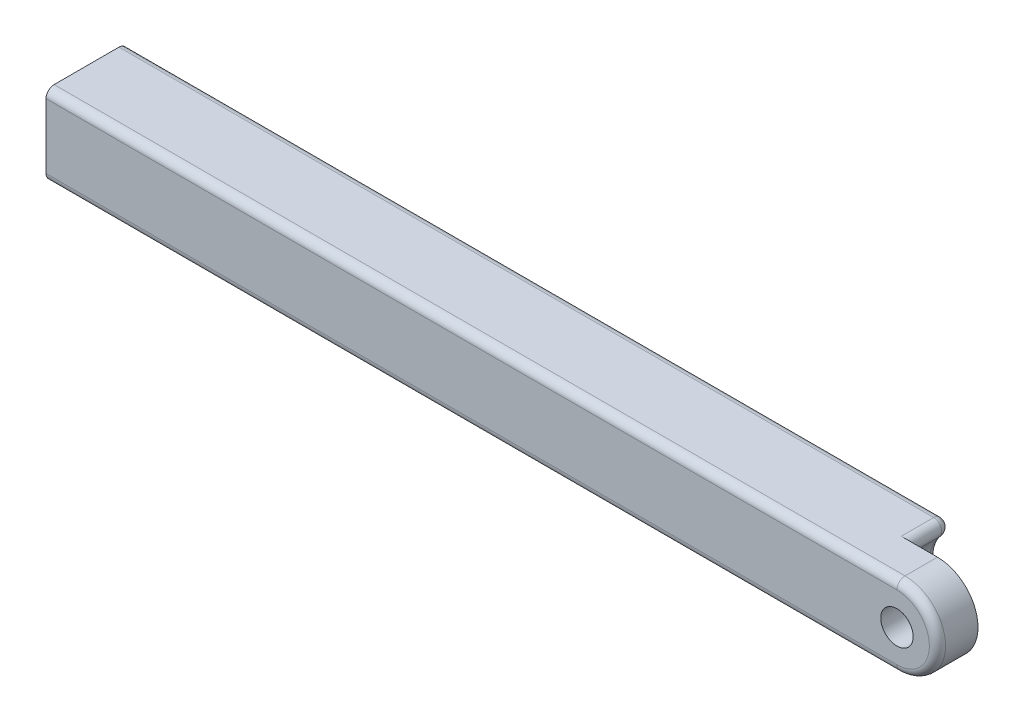
ISO-10303-21;
HEADER;
FILE_DESCRIPTION(('STEP AP214'),'2;1');
FILE_NAME('part.step','',(''),(''),'','','');
FILE_SCHEMA(('AUTOMOTIVE_DESIGN { 1 0 10303 214 1 1 1 1 }'));
ENDSEC;
DATA;
#1=APPLICATION_CONTEXT('core data for automotive mechanical design processes');
#2=APPLICATION_PROTOCOL_DEFINITION('international standard','automotive_design',2000,#1);
#3=PRODUCT_CONTEXT('',#1,'mechanical');
#4=PRODUCT('Part','Part','',(#3));
#5=PRODUCT_RELATED_PRODUCT_CATEGORY('part','',(#4));
#6=PRODUCT_DEFINITION_FORMATION('','',#4);
#7=PRODUCT_DEFINITION_CONTEXT('part definition',#1,'design');
#8=PRODUCT_DEFINITION('design','',#6,#7);
#9=PRODUCT_DEFINITION_SHAPE('','',#8);
#10=(LENGTH_UNIT() NAMED_UNIT(*) SI_UNIT(.MILLI.,.METRE.));
#11=(NAMED_UNIT(*) PLANE_ANGLE_UNIT() SI_UNIT($,.RADIAN.));
#12=(NAMED_UNIT(*) SI_UNIT($,.STERADIAN.) SOLID_ANGLE_UNIT());
#13=UNCERTAINTY_MEASURE_WITH_UNIT(LENGTH_MEASURE(1.E-05),#10,'distance_accuracy_value','');
#14=(GEOMETRIC_REPRESENTATION_CONTEXT(3) GLOBAL_UNCERTAINTY_ASSIGNED_CONTEXT((#13)) GLOBAL_UNIT_ASSIGNED_CONTEXT((#10,
#11,#12)) REPRESENTATION_CONTEXT('',''));
#15=CARTESIAN_POINT('',(0.,0.,0.));
#16=DIRECTION('',(0.,0.,1.));
#17=DIRECTION('',(1.,0.,0.));
#18=AXIS2_PLACEMENT_3D('',#15,#16,#17);
#19=CARTESIAN_POINT('',(0.,100.,-100.));
#20=DIRECTION('',(0.,0.,1.));
#21=DIRECTION('',(1.,0.,0.));
#22=AXIS2_PLACEMENT_3D('',#19,#20,#21);
#23=PLANE('',#22);
#24=DIRECTION('',(-1.,0.,0.));
#25=VECTOR('',#24,1.);
#26=CARTESIAN_POINT('',(0.,90.,-100.));
#27=LINE('',#26,#25);
#28=CARTESIAN_POINT('',(-1050.,90.,-99.9999999999999));
#29=VERTEX_POINT('',#28);
#30=CARTESIAN_POINT('',(-44.7213595499958,90.,-100.));
#31=VERTEX_POINT('',#30);
#32=EDGE_CURVE('E175',#29,#31,#27,.F.);
#33=ORIENTED_EDGE('',*,*,#32,.T.);
#34=CARTESIAN_POINT('',(0.,50.,-100.));
#35=DIRECTION('',(0.,0.,1.));
#36=DIRECTION('',(1.,0.,0.));
#37=AXIS2_PLACEMENT_3D('',#34,#35,#36);
#38=CIRCLE('',#37,60.);
#39=CARTESIAN_POINT('',(-44.7213595499958,9.99999999999999,-100.));
#40=VERTEX_POINT('',#39);
#41=EDGE_CURVE('E192',#31,#40,#38,.T.);
#42=ORIENTED_EDGE('',*,*,#41,.T.);
#43=DIRECTION('',(-1.,0.,0.));
#44=VECTOR('',#43,1.);
#45=CARTESIAN_POINT('',(0.,9.99999999999999,-100.));
#46=LINE('',#45,#44);
#47=CARTESIAN_POINT('',(-1050.,9.99999999999999,-99.9999999999999));
#48=VERTEX_POINT('',#47);
#49=EDGE_CURVE('E177',#40,#48,#46,.T.);
#50=ORIENTED_EDGE('',*,*,#49,.T.);
#51=DIRECTION('',(0.,-1.,0.));
#52=VECTOR('',#51,1.);
#53=CARTESIAN_POINT('',(-1050.,100.,-99.9999999999999));
#54=LINE('',#53,#52);
#55=EDGE_CURVE('E145',#29,#48,#54,.T.);
#56=ORIENTED_EDGE('',*,*,#55,.F.);
#57=EDGE_LOOP('',(#33,#42,#50,#56));
#58=FACE_BOUND('',#57,.T.);
#59=ADVANCED_FACE('F32',(#58),#23,.F.);
#60=CARTESIAN_POINT('',(-1050.,100.,1.2858366715135E-13));
#61=DIRECTION('',(1.,0.,0.));
#62=DIRECTION('',(0.,0.,-1.));
#63=AXIS2_PLACEMENT_3D('',#60,#61,#62);
#64=PLANE('',#63);
#65=DIRECTION('',(0.,-1.,0.));
#66=VECTOR('',#65,1.);
#67=CARTESIAN_POINT('',(-1050.,100.,1.2858366715135E-13));
#68=LINE('',#67,#66);
#69=CARTESIAN_POINT('',(-1050.,90.,1.2858366715135E-13));
#70=VERTEX_POINT('',#69);
#71=CARTESIAN_POINT('',(-1050.,9.99999999999999,1.2858366715135E-13));
#72=VERTEX_POINT('',#71);
#73=EDGE_CURVE('E150',#70,#72,#68,.T.);
#74=ORIENTED_EDGE('',*,*,#73,.F.);
#75=CARTESIAN_POINT('',(-1050.,90.,-9.99999999999987));
#76=DIRECTION('',(1.,0.,0.));
#77=DIRECTION('',(0.,0.,-1.));
#78=AXIS2_PLACEMENT_3D('',#75,#76,#77);
#79=CIRCLE('',#78,10.);
#80=CARTESIAN_POINT('',(-1050.,100.,-9.99999999999987));
#81=VERTEX_POINT('',#80);
#82=EDGE_CURVE('E168',#70,#81,#79,.F.);
#83=ORIENTED_EDGE('',*,*,#82,.T.);
#84=DIRECTION('',(0.,0.,1.));
#85=VECTOR('',#84,1.);
#86=CARTESIAN_POINT('',(-1050.,100.,1.2858366715135E-13));
#87=LINE('',#86,#85);
#88=CARTESIAN_POINT('',(-1050.,100.,-89.9999999999999));
#89=VERTEX_POINT('',#88);
#90=EDGE_CURVE('E246',#89,#81,#87,.T.);
#91=ORIENTED_EDGE('',*,*,#90,.F.);
#92=CARTESIAN_POINT('',(-1050.,90.,-89.9999999999999));
#93=DIRECTION('',(1.,0.,0.));
#94=DIRECTION('',(0.,0.,-1.));
#95=AXIS2_PLACEMENT_3D('',#92,#93,#94);
#96=CIRCLE('',#95,10.);
#97=EDGE_CURVE('E162',#89,#29,#96,.F.);
#98=ORIENTED_EDGE('',*,*,#97,.T.);
#99=ORIENTED_EDGE('',*,*,#55,.T.);
#100=CARTESIAN_POINT('',(-1050.,9.99999999999999,-89.9999999999999));
#101=DIRECTION('',(1.,0.,0.));
#102=DIRECTION('',(0.,0.,-1.));
#103=AXIS2_PLACEMENT_3D('',#100,#101,#102);
#104=CIRCLE('',#103,10.);
#105=CARTESIAN_POINT('',(-1050.,0.,-89.9999999999999));
#106=VERTEX_POINT('',#105);
#107=EDGE_CURVE('E164',#48,#106,#104,.F.);
#108=ORIENTED_EDGE('',*,*,#107,.T.);
#109=DIRECTION('',(0.,0.,1.));
#110=VECTOR('',#109,1.);
#111=CARTESIAN_POINT('',(-1050.,0.,1.2858366715135E-13));
#112=LINE('',#111,#110);
#113=CARTESIAN_POINT('',(-1050.,0.,-9.99999999999987));
#114=VERTEX_POINT('',#113);
#115=EDGE_CURVE('E140',#106,#114,#112,.T.);
#116=ORIENTED_EDGE('',*,*,#115,.T.);
#117=CARTESIAN_POINT('',(-1050.,9.99999999999999,-9.99999999999987));
#118=DIRECTION('',(1.,0.,0.));
#119=DIRECTION('',(0.,0.,-1.));
#120=AXIS2_PLACEMENT_3D('',#117,#118,#119);
#121=CIRCLE('',#120,10.);
#122=EDGE_CURVE('E166',#114,#72,#121,.F.);
#123=ORIENTED_EDGE('',*,*,#122,.T.);
#124=EDGE_LOOP('',(#74,#83,#91,#98,#99,#108,#116,#123));
#125=FACE_BOUND('',#124,.T.);
#126=ADVANCED_FACE('F268',(#125),#64,.F.);
#127=CARTESIAN_POINT('',(0.,100.,0.));
#128=DIRECTION('',(0.,0.,-1.));
#129=DIRECTION('',(-1.,0.,0.));
#130=AXIS2_PLACEMENT_3D('',#127,#128,#129);
#131=PLANE('',#130);
#132=CARTESIAN_POINT('',(0.,50.,0.));
#133=DIRECTION('',(0.,0.,-1.));
#134=DIRECTION('',(-1.,0.,0.));
#135=AXIS2_PLACEMENT_3D('',#132,#133,#134);
#136=CIRCLE('',#135,20.);
#137=CARTESIAN_POINT('',(-20.,50.,0.));
#138=VERTEX_POINT('',#137);
#139=EDGE_CURVE('E201',#138,#138,#136,.T.);
#140=ORIENTED_EDGE('',*,*,#139,.T.);
#141=EDGE_LOOP('',(#140));
#142=FACE_BOUND('',#141,.T.);
#143=CARTESIAN_POINT('',(0.,50.,0.));
#144=DIRECTION('',(0.,0.,-1.));
#145=DIRECTION('',(-1.,0.,0.));
#146=AXIS2_PLACEMENT_3D('',#143,#144,#145);
#147=CIRCLE('',#146,40.);
#148=CARTESIAN_POINT('',(0.,9.99999999999999,0.));
#149=VERTEX_POINT('',#148);
#150=CARTESIAN_POINT('',(0.,90.,0.));
#151=VERTEX_POINT('',#150);
#152=EDGE_CURVE('E158',#149,#151,#147,.F.);
#153=ORIENTED_EDGE('',*,*,#152,.T.);
#154=DIRECTION('',(1.,0.,0.));
#155=VECTOR('',#154,1.);
#156=CARTESIAN_POINT('',(-1050.,90.,1.2858366715135E-13));
#157=LINE('',#156,#155);
#158=EDGE_CURVE('E160',#151,#70,#157,.F.);
#159=ORIENTED_EDGE('',*,*,#158,.T.);
#160=ORIENTED_EDGE('',*,*,#73,.T.);
#161=DIRECTION('',(1.,0.,0.));
#162=VECTOR('',#161,1.);
#163=CARTESIAN_POINT('',(0.,9.99999999999999,0.));
#164=LINE('',#163,#162);
#165=EDGE_CURVE('E156',#72,#149,#164,.T.);
#166=ORIENTED_EDGE('',*,*,#165,.T.);
#167=EDGE_LOOP('',(#153,#159,#160,#166));
#168=FACE_BOUND('',#167,.T.);
#169=ADVANCED_FACE('F252',(#142,#168),#131,.F.);
#170=CARTESIAN_POINT('',(0.,100.,-100.));
#171=DIRECTION('',(0.,1.,0.));
#172=DIRECTION('',(0.,0.,1.));
#173=AXIS2_PLACEMENT_3D('',#170,#171,#172);
#174=PLANE('',#173);
#175=DIRECTION('',(-1.,0.,0.));
#176=VECTOR('',#175,1.);
#177=CARTESIAN_POINT('',(0.,100.,-50.));
#178=LINE('',#177,#176);
#179=CARTESIAN_POINT('',(0.,100.,-50.));
#180=VERTEX_POINT('',#179);
#181=CARTESIAN_POINT('',(-44.7213595499958,100.,-50.));
#182=VERTEX_POINT('',#181);
#183=EDGE_CURVE('E45',#180,#182,#178,.T.);
#184=ORIENTED_EDGE('',*,*,#183,.T.);
#185=DIRECTION('',(0.,0.,1.));
#186=VECTOR('',#185,1.);
#187=CARTESIAN_POINT('',(-44.7213595499958,100.,-90.));
#188=LINE('',#187,#186);
#189=CARTESIAN_POINT('',(-44.7213595499958,100.,-90.));
#190=VERTEX_POINT('',#189);
#191=EDGE_CURVE('E187',#182,#190,#188,.F.);
#192=ORIENTED_EDGE('',*,*,#191,.T.);
#193=DIRECTION('',(-1.,0.,0.));
#194=VECTOR('',#193,1.);
#195=CARTESIAN_POINT('',(-1050.,100.,-89.9999999999999));
#196=LINE('',#195,#194);
#197=EDGE_CURVE('E144',#190,#89,#196,.T.);
#198=ORIENTED_EDGE('',*,*,#197,.T.);
#199=ORIENTED_EDGE('',*,*,#90,.T.);
#200=DIRECTION('',(1.,0.,0.));
#201=VECTOR('',#200,1.);
#202=CARTESIAN_POINT('',(0.,100.,-9.99999999999999));
#203=LINE('',#202,#201);
#204=CARTESIAN_POINT('',(0.,100.,-10.));
#205=VERTEX_POINT('',#204);
#206=EDGE_CURVE('E147',#81,#205,#203,.T.);
#207=ORIENTED_EDGE('',*,*,#206,.T.);
#208=DIRECTION('',(0.,0.,-1.));
#209=VECTOR('',#208,1.);
#210=CARTESIAN_POINT('',(0.,100.,0.));
#211=LINE('',#210,#209);
#212=EDGE_CURVE('E244',#205,#180,#211,.T.);
#213=ORIENTED_EDGE('',*,*,#212,.T.);
#214=EDGE_LOOP('',(#184,#192,#198,#199,#207,#213));
#215=FACE_BOUND('',#214,.T.);
#216=ADVANCED_FACE('F270',(#215),#174,.T.);
#217=CARTESIAN_POINT('',(0.,0.,-100.));
#218=DIRECTION('',(0.,1.,0.));
#219=DIRECTION('',(0.,0.,1.));
#220=AXIS2_PLACEMENT_3D('',#217,#218,#219);
#221=PLANE('',#220);
#222=DIRECTION('',(-1.,0.,0.));
#223=VECTOR('',#222,1.);
#224=CARTESIAN_POINT('',(0.,0.,-90.));
#225=LINE('',#224,#223);
#226=CARTESIAN_POINT('',(-44.7213595499958,0.,-90.));
#227=VERTEX_POINT('',#226);
#228=EDGE_CURVE('E171',#106,#227,#225,.F.);
#229=ORIENTED_EDGE('',*,*,#228,.T.);
#230=DIRECTION('',(0.,0.,-1.));
#231=VECTOR('',#230,1.);
#232=CARTESIAN_POINT('',(-44.7213595499958,0.,-100.));
#233=LINE('',#232,#231);
#234=CARTESIAN_POINT('',(-44.7213595499958,0.,-50.));
#235=VERTEX_POINT('',#234);
#236=EDGE_CURVE('E129',#227,#235,#233,.F.);
#237=ORIENTED_EDGE('',*,*,#236,.T.);
#238=DIRECTION('',(1.,0.,0.));
#239=VECTOR('',#238,1.);
#240=CARTESIAN_POINT('',(0.,0.,-50.));
#241=LINE('',#240,#239);
#242=CARTESIAN_POINT('',(0.,0.,-50.));
#243=VERTEX_POINT('',#242);
#244=EDGE_CURVE('E122',#235,#243,#241,.T.);
#245=ORIENTED_EDGE('',*,*,#244,.T.);
#246=DIRECTION('',(0.,0.,-1.));
#247=VECTOR('',#246,1.);
#248=CARTESIAN_POINT('',(0.,0.,0.));
#249=LINE('',#248,#247);
#250=CARTESIAN_POINT('',(0.,0.,-10.));
#251=VERTEX_POINT('',#250);
#252=EDGE_CURVE('E126',#251,#243,#249,.T.);
#253=ORIENTED_EDGE('',*,*,#252,.F.);
#254=DIRECTION('',(1.,0.,0.));
#255=VECTOR('',#254,1.);
#256=CARTESIAN_POINT('',(0.,0.,-9.99999999999999));
#257=LINE('',#256,#255);
#258=EDGE_CURVE('E173',#251,#114,#257,.F.);
#259=ORIENTED_EDGE('',*,*,#258,.T.);
#260=ORIENTED_EDGE('',*,*,#115,.F.);
#261=EDGE_LOOP('',(#229,#237,#245,#253,#259,#260));
#262=FACE_BOUND('',#261,.T.);
#263=ADVANCED_FACE('F125',(#262),#221,.F.);
#264=CARTESIAN_POINT('',(0.,50.,141.42135623731));
#265=DIRECTION('',(0.,0.,-1.));
#266=DIRECTION('',(-1.,0.,0.));
#267=AXIS2_PLACEMENT_3D('',#264,#265,#266);
#268=CYLINDRICAL_SURFACE('',#267,50.);
#269=ORIENTED_EDGE('',*,*,#212,.F.);
#270=CARTESIAN_POINT('',(0.,50.,-10.));
#271=DIRECTION('',(0.,0.,-1.));
#272=DIRECTION('',(-1.,0.,0.));
#273=AXIS2_PLACEMENT_3D('',#270,#271,#272);
#274=CIRCLE('',#273,50.);
#275=EDGE_CURVE('E139',#205,#251,#274,.T.);
#276=ORIENTED_EDGE('',*,*,#275,.T.);
#277=ORIENTED_EDGE('',*,*,#252,.T.);
#278=CARTESIAN_POINT('',(0.,50.,-50.));
#279=DIRECTION('',(0.,0.,1.));
#280=DIRECTION('',(1.,0.,0.));
#281=AXIS2_PLACEMENT_3D('',#278,#279,#280);
#282=CIRCLE('',#281,50.);
#283=EDGE_CURVE('E137',#180,#243,#282,.F.);
#284=ORIENTED_EDGE('',*,*,#283,.F.);
#285=EDGE_LOOP('',(#269,#276,#277,#284));
#286=FACE_BOUND('',#285,.T.);
#287=ADVANCED_FACE('F136',(#286),#268,.T.);
#288=CARTESIAN_POINT('',(0.,50.,141.42135623731));
#289=DIRECTION('',(0.,0.,-1.));
#290=DIRECTION('',(-1.,0.,0.));
#291=AXIS2_PLACEMENT_3D('',#288,#289,#290);
#292=CYLINDRICAL_SURFACE('',#291,50.);
#293=CARTESIAN_POINT('',(0.,50.,-50.));
#294=DIRECTION('',(0.,0.,1.));
#295=DIRECTION('',(1.,0.,0.));
#296=AXIS2_PLACEMENT_3D('',#293,#294,#295);
#297=CIRCLE('',#296,50.);
#298=CARTESIAN_POINT('',(-37.2677996249965,16.6666666666667,-50.));
#299=VERTEX_POINT('',#298);
#300=CARTESIAN_POINT('',(-37.2677996249965,83.3333333333333,-50.));
#301=VERTEX_POINT('',#300);
#302=EDGE_CURVE('E141',#299,#301,#297,.F.);
#303=ORIENTED_EDGE('',*,*,#302,.F.);
#304=DIRECTION('',(0.,0.,-1.));
#305=VECTOR('',#304,1.);
#306=CARTESIAN_POINT('',(-37.2677996249965,16.6666666666667,141.42135623731));
#307=LINE('',#306,#305);
#308=CARTESIAN_POINT('',(-37.2677996249965,16.6666666666667,-90.));
#309=VERTEX_POINT('',#308);
#310=EDGE_CURVE('E131',#299,#309,#307,.T.);
#311=ORIENTED_EDGE('',*,*,#310,.T.);
#312=CARTESIAN_POINT('',(0.,50.,-90.));
#313=DIRECTION('',(0.,0.,1.));
#314=DIRECTION('',(1.,0.,0.));
#315=AXIS2_PLACEMENT_3D('',#312,#313,#314);
#316=CIRCLE('',#315,50.);
#317=CARTESIAN_POINT('',(-37.2677996249965,83.3333333333333,-90.));
#318=VERTEX_POINT('',#317);
#319=EDGE_CURVE('E179',#309,#318,#316,.F.);
#320=ORIENTED_EDGE('',*,*,#319,.T.);
#321=DIRECTION('',(0.,0.,-1.));
#322=VECTOR('',#321,1.);
#323=CARTESIAN_POINT('',(-37.2677996249965,83.3333333333333,141.42135623731));
#324=LINE('',#323,#322);
#325=EDGE_CURVE('E181',#318,#301,#324,.F.);
#326=ORIENTED_EDGE('',*,*,#325,.T.);
#327=EDGE_LOOP('',(#303,#311,#320,#326));
#328=FACE_BOUND('',#327,.T.);
#329=ADVANCED_FACE('F199',(#328),#292,.F.);
#330=CARTESIAN_POINT('',(0.,100.,-50.));
#331=DIRECTION('',(0.,0.,1.));
#332=DIRECTION('',(1.,0.,0.));
#333=AXIS2_PLACEMENT_3D('',#330,#331,#332);
#334=PLANE('',#333);
#335=CARTESIAN_POINT('',(0.,50.,-50.));
#336=DIRECTION('',(0.,0.,-1.));
#337=DIRECTION('',(-1.,0.,0.));
#338=AXIS2_PLACEMENT_3D('',#335,#336,#337);
#339=CIRCLE('',#338,20.);
#340=CARTESIAN_POINT('',(-20.,50.,-50.));
#341=VERTEX_POINT('',#340);
#342=EDGE_CURVE('E237',#341,#341,#339,.T.);
#343=ORIENTED_EDGE('',*,*,#342,.F.);
#344=EDGE_LOOP('',(#343));
#345=FACE_BOUND('',#344,.T.);
#346=ORIENTED_EDGE('',*,*,#283,.T.);
#347=ORIENTED_EDGE('',*,*,#244,.F.);
#348=CARTESIAN_POINT('',(-44.7213595499958,10.,-50.));
#349=DIRECTION('',(0.,0.,1.));
#350=DIRECTION('',(1.,0.,0.));
#351=AXIS2_PLACEMENT_3D('',#348,#349,#350);
#352=CIRCLE('',#351,10.);
#353=EDGE_CURVE('E39',#235,#299,#352,.T.);
#354=ORIENTED_EDGE('',*,*,#353,.T.);
#355=ORIENTED_EDGE('',*,*,#302,.T.);
#356=CARTESIAN_POINT('',(-44.7213595499958,90.,-50.));
#357=DIRECTION('',(0.,0.,1.));
#358=DIRECTION('',(1.,0.,0.));
#359=AXIS2_PLACEMENT_3D('',#356,#357,#358);
#360=CIRCLE('',#359,10.);
#361=EDGE_CURVE('E12',#301,#182,#360,.T.);
#362=ORIENTED_EDGE('',*,*,#361,.T.);
#363=ORIENTED_EDGE('',*,*,#183,.F.);
#364=EDGE_LOOP('',(#346,#347,#354,#355,#362,#363));
#365=FACE_BOUND('',#364,.T.);
#366=ADVANCED_FACE('F143',(#345,#365),#334,.F.);
#367=CARTESIAN_POINT('',(0.,50.,0.));
#368=DIRECTION('',(0.,0.,-1.));
#369=DIRECTION('',(-1.,0.,0.));
#370=AXIS2_PLACEMENT_3D('',#367,#368,#369);
#371=CYLINDRICAL_SURFACE('',#370,20.);
#372=ORIENTED_EDGE('',*,*,#139,.F.);
#373=EDGE_LOOP('',(#372));
#374=FACE_BOUND('',#373,.T.);
#375=ORIENTED_EDGE('',*,*,#342,.T.);
#376=EDGE_LOOP('',(#375));
#377=FACE_BOUND('',#376,.T.);
#378=ADVANCED_FACE('F307',(#374,#377),#371,.F.);
#379=CARTESIAN_POINT('',(0.,9.99999999999999,-10.));
#380=DIRECTION('',(1.,0.,0.));
#381=DIRECTION('',(0.,0.,-1.));
#382=AXIS2_PLACEMENT_3D('',#379,#380,#381);
#383=CYLINDRICAL_SURFACE('',#382,10.);
#384=ORIENTED_EDGE('',*,*,#122,.F.);
#385=ORIENTED_EDGE('',*,*,#258,.F.);
#386=CARTESIAN_POINT('',(0.,9.99999999999999,-10.));
#387=DIRECTION('',(1.,0.,0.));
#388=DIRECTION('',(0.,1.,0.));
#389=AXIS2_PLACEMENT_3D('',#386,#387,#388);
#390=CIRCLE('',#389,10.);
#391=EDGE_CURVE('E231',#149,#251,#390,.T.);
#392=ORIENTED_EDGE('',*,*,#391,.F.);
#393=ORIENTED_EDGE('',*,*,#165,.F.);
#394=EDGE_LOOP('',(#384,#385,#392,#393));
#395=FACE_BOUND('',#394,.T.);
#396=ADVANCED_FACE('F259',(#395),#383,.T.);
#397=CARTESIAN_POINT('',(0.,50.,-10.));
#398=DIRECTION('',(0.,0.,-1.));
#399=DIRECTION('',(-1.,0.,0.));
#400=AXIS2_PLACEMENT_3D('',#397,#398,#399);
#401=TOROIDAL_SURFACE('',#400,40.,10.);
#402=ORIENTED_EDGE('',*,*,#391,.T.);
#403=ORIENTED_EDGE('',*,*,#275,.F.);
#404=CARTESIAN_POINT('',(0.,90.,-10.));
#405=DIRECTION('',(-1.,0.,0.));
#406=DIRECTION('',(0.,0.,1.));
#407=AXIS2_PLACEMENT_3D('',#404,#405,#406);
#408=CIRCLE('',#407,10.);
#409=EDGE_CURVE('E229',#151,#205,#408,.T.);
#410=ORIENTED_EDGE('',*,*,#409,.F.);
#411=ORIENTED_EDGE('',*,*,#152,.F.);
#412=EDGE_LOOP('',(#402,#403,#410,#411));
#413=FACE_BOUND('',#412,.T.);
#414=ADVANCED_FACE('F263',(#413),#401,.T.);
#415=CARTESIAN_POINT('',(0.,90.,-9.99999999999999));
#416=DIRECTION('',(-1.,0.,0.));
#417=DIRECTION('',(0.,0.,1.));
#418=AXIS2_PLACEMENT_3D('',#415,#416,#417);
#419=CYLINDRICAL_SURFACE('',#418,10.);
#420=ORIENTED_EDGE('',*,*,#82,.F.);
#421=ORIENTED_EDGE('',*,*,#158,.F.);
#422=ORIENTED_EDGE('',*,*,#409,.T.);
#423=ORIENTED_EDGE('',*,*,#206,.F.);
#424=EDGE_LOOP('',(#420,#421,#422,#423));
#425=FACE_BOUND('',#424,.T.);
#426=ADVANCED_FACE('F265',(#425),#419,.T.);
#427=CARTESIAN_POINT('',(0.,9.99999999999999,-90.));
#428=DIRECTION('',(-1.,0.,0.));
#429=DIRECTION('',(0.,0.,1.));
#430=AXIS2_PLACEMENT_3D('',#427,#428,#429);
#431=CYLINDRICAL_SURFACE('',#430,10.);
#432=ORIENTED_EDGE('',*,*,#49,.F.);
#433=CARTESIAN_POINT('',(-44.7213595499958,9.99999999999999,-90.));
#434=DIRECTION('',(-1.,0.,0.));
#435=DIRECTION('',(0.,0.,1.));
#436=AXIS2_PLACEMENT_3D('',#433,#434,#435);
#437=CIRCLE('',#436,10.);
#438=EDGE_CURVE('E189',#40,#227,#437,.T.);
#439=ORIENTED_EDGE('',*,*,#438,.T.);
#440=ORIENTED_EDGE('',*,*,#228,.F.);
#441=ORIENTED_EDGE('',*,*,#107,.F.);
#442=EDGE_LOOP('',(#432,#439,#440,#441));
#443=FACE_BOUND('',#442,.T.);
#444=ADVANCED_FACE('F279',(#443),#431,.T.);
#445=CARTESIAN_POINT('',(0.,90.,-90.));
#446=DIRECTION('',(1.,0.,0.));
#447=DIRECTION('',(0.,0.,-1.));
#448=AXIS2_PLACEMENT_3D('',#445,#446,#447);
#449=CYLINDRICAL_SURFACE('',#448,10.);
#450=ORIENTED_EDGE('',*,*,#197,.F.);
#451=CARTESIAN_POINT('',(-44.7213595499958,90.,-90.));
#452=DIRECTION('',(1.,0.,0.));
#453=DIRECTION('',(0.,0.,-1.));
#454=AXIS2_PLACEMENT_3D('',#451,#452,#453);
#455=CIRCLE('',#454,10.);
#456=EDGE_CURVE('E53',#190,#31,#455,.F.);
#457=ORIENTED_EDGE('',*,*,#456,.T.);
#458=ORIENTED_EDGE('',*,*,#32,.F.);
#459=ORIENTED_EDGE('',*,*,#97,.F.);
#460=EDGE_LOOP('',(#450,#457,#458,#459));
#461=FACE_BOUND('',#460,.T.);
#462=ADVANCED_FACE('F272',(#461),#449,.T.);
#463=CARTESIAN_POINT('',(-44.7213595499958,90.,141.42135623731));
#464=DIRECTION('',(0.,0.,-1.));
#465=DIRECTION('',(-1.,0.,0.));
#466=AXIS2_PLACEMENT_3D('',#463,#464,#465);
#467=CYLINDRICAL_SURFACE('',#466,10.);
#468=CARTESIAN_POINT('',(-44.7213595499958,90.,-90.));
#469=DIRECTION('',(0.,0.,-1.));
#470=DIRECTION('',(-1.,0.,0.));
#471=AXIS2_PLACEMENT_3D('',#468,#469,#470);
#472=CIRCLE('',#471,10.);
#473=EDGE_CURVE('E226',#190,#318,#472,.T.);
#474=ORIENTED_EDGE('',*,*,#473,.F.);
#475=ORIENTED_EDGE('',*,*,#191,.F.);
#476=ORIENTED_EDGE('',*,*,#361,.F.);
#477=ORIENTED_EDGE('',*,*,#325,.F.);
#478=EDGE_LOOP('',(#474,#475,#476,#477));
#479=FACE_BOUND('',#478,.T.);
#480=ADVANCED_FACE('F224',(#479),#467,.T.);
#481=CARTESIAN_POINT('',(-44.7213595499958,90.,-90.));
#482=DIRECTION('',(0.,0.,1.));
#483=DIRECTION('',(1.,0.,0.));
#484=AXIS2_PLACEMENT_3D('',#481,#482,#483);
#485=SPHERICAL_SURFACE('',#484,10.);
#486=ORIENTED_EDGE('',*,*,#456,.F.);
#487=ORIENTED_EDGE('',*,*,#473,.T.);
#488=CARTESIAN_POINT('',(-44.7213595499958,90.,-90.));
#489=DIRECTION('',(-0.666666666666667,-0.74535599249993,0.));
#490=DIRECTION('',(0.74535599249993,-0.666666666666667,0.));
#491=AXIS2_PLACEMENT_3D('',#488,#489,#490);
#492=CIRCLE('',#491,10.);
#493=EDGE_CURVE('E216',#31,#318,#492,.T.);
#494=ORIENTED_EDGE('',*,*,#493,.F.);
#495=EDGE_LOOP('',(#486,#487,#494));
#496=FACE_BOUND('',#495,.T.);
#497=ADVANCED_FACE('F228',(#496),#485,.T.);
#498=CARTESIAN_POINT('',(0.,50.,-90.));
#499=DIRECTION('',(0.,0.,1.));
#500=DIRECTION('',(1.,0.,0.));
#501=AXIS2_PLACEMENT_3D('',#498,#499,#500);
#502=TOROIDAL_SURFACE('',#501,60.,10.);
#503=CARTESIAN_POINT('',(-44.7213595499958,9.99999999999999,-90.));
#504=DIRECTION('',(0.666666666666667,-0.74535599249993,0.));
#505=DIRECTION('',(0.74535599249993,0.666666666666667,0.));
#506=AXIS2_PLACEMENT_3D('',#503,#504,#505);
#507=CIRCLE('',#506,10.);
#508=EDGE_CURVE('E209',#40,#309,#507,.T.);
#509=ORIENTED_EDGE('',*,*,#508,.F.);
#510=ORIENTED_EDGE('',*,*,#41,.F.);
#511=ORIENTED_EDGE('',*,*,#493,.T.);
#512=ORIENTED_EDGE('',*,*,#319,.F.);
#513=EDGE_LOOP('',(#509,#510,#511,#512));
#514=FACE_BOUND('',#513,.T.);
#515=ADVANCED_FACE('F219',(#514),#502,.T.);
#516=CARTESIAN_POINT('',(-44.7213595499958,9.99999999999999,-90.));
#517=DIRECTION('',(0.,0.,1.));
#518=DIRECTION('',(1.,0.,0.));
#519=AXIS2_PLACEMENT_3D('',#516,#517,#518);
#520=SPHERICAL_SURFACE('',#519,10.);
#521=ORIENTED_EDGE('',*,*,#438,.F.);
#522=ORIENTED_EDGE('',*,*,#508,.T.);
#523=CARTESIAN_POINT('',(-44.7213595499958,9.99999999999999,-90.));
#524=DIRECTION('',(0.,0.,1.));
#525=DIRECTION('',(1.,0.,0.));
#526=AXIS2_PLACEMENT_3D('',#523,#524,#525);
#527=CIRCLE('',#526,10.);
#528=EDGE_CURVE('E205',#227,#309,#527,.T.);
#529=ORIENTED_EDGE('',*,*,#528,.F.);
#530=EDGE_LOOP('',(#521,#522,#529));
#531=FACE_BOUND('',#530,.T.);
#532=ADVANCED_FACE('F213',(#531),#520,.T.);
#533=CARTESIAN_POINT('',(-44.7213595499958,10.,141.42135623731));
#534=DIRECTION('',(0.,0.,-1.));
#535=DIRECTION('',(-1.,0.,0.));
#536=AXIS2_PLACEMENT_3D('',#533,#534,#535);
#537=CYLINDRICAL_SURFACE('',#536,10.);
#538=ORIENTED_EDGE('',*,*,#353,.F.);
#539=ORIENTED_EDGE('',*,*,#236,.F.);
#540=ORIENTED_EDGE('',*,*,#528,.T.);
#541=ORIENTED_EDGE('',*,*,#310,.F.);
#542=EDGE_LOOP('',(#538,#539,#540,#541));
#543=FACE_BOUND('',#542,.T.);
#544=ADVANCED_FACE('F203',(#543),#537,.T.);
#545=CLOSED_SHELL('',(#59,#126,#169,#216,#263,#287,#329,#366,#378,#396,#414,#426,#444,#462,#480,
#497,#515,#532,#544));
#546=MANIFOLD_SOLID_BREP('B2',#545);
#547=ADVANCED_BREP_SHAPE_REPRESENTATION('',(#18,#546),#14);
#548=SHAPE_DEFINITION_REPRESENTATION(#9,#547);
ENDSEC;
END-ISO-10303-21;
